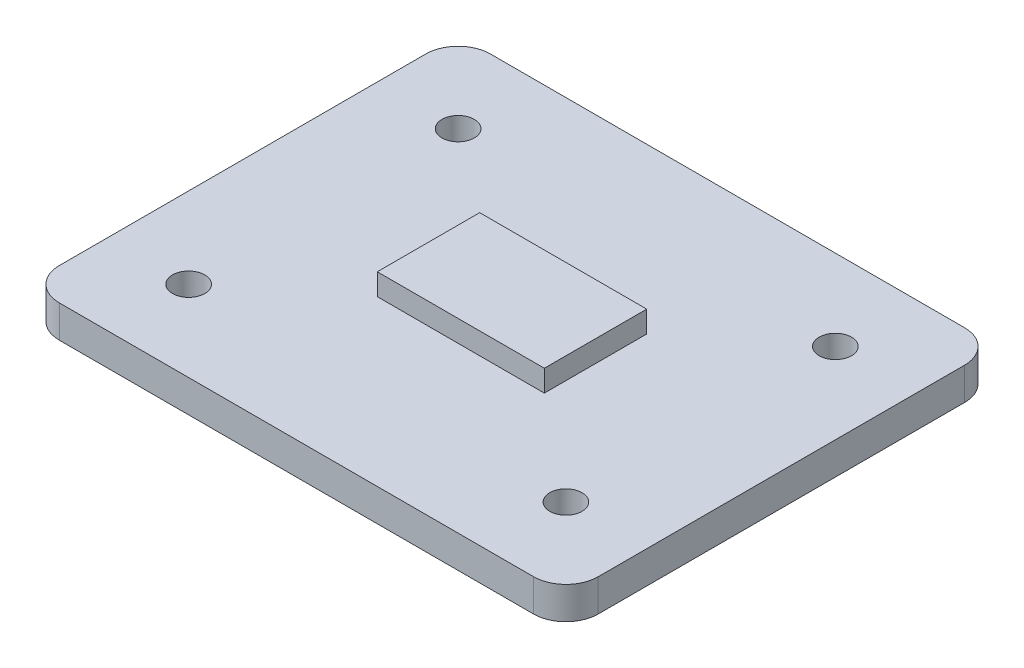
ISO-10303-21;
HEADER;
FILE_DESCRIPTION(('STEP AP214'),'2;1');
FILE_NAME('part.step','',(''),(''),'','','');
FILE_SCHEMA(('AUTOMOTIVE_DESIGN { 1 0 10303 214 1 1 1 1 }'));
ENDSEC;
DATA;
#1=APPLICATION_CONTEXT('core data for automotive mechanical design processes');
#2=APPLICATION_PROTOCOL_DEFINITION('international standard','automotive_design',2000,#1);
#3=PRODUCT_CONTEXT('',#1,'mechanical');
#4=PRODUCT('Part','Part','',(#3));
#5=PRODUCT_RELATED_PRODUCT_CATEGORY('part','',(#4));
#6=PRODUCT_DEFINITION_FORMATION('','',#4);
#7=PRODUCT_DEFINITION_CONTEXT('part definition',#1,'design');
#8=PRODUCT_DEFINITION('design','',#6,#7);
#9=PRODUCT_DEFINITION_SHAPE('','',#8);
#10=(LENGTH_UNIT() NAMED_UNIT(*) SI_UNIT(.MILLI.,.METRE.));
#11=(NAMED_UNIT(*) PLANE_ANGLE_UNIT() SI_UNIT($,.RADIAN.));
#12=(NAMED_UNIT(*) SI_UNIT($,.STERADIAN.) SOLID_ANGLE_UNIT());
#13=UNCERTAINTY_MEASURE_WITH_UNIT(LENGTH_MEASURE(1.E-05),#10,'distance_accuracy_value','');
#14=(GEOMETRIC_REPRESENTATION_CONTEXT(3) GLOBAL_UNCERTAINTY_ASSIGNED_CONTEXT((#13)) GLOBAL_UNIT_ASSIGNED_CONTEXT((#10,
#11,#12)) REPRESENTATION_CONTEXT('',''));
#15=CARTESIAN_POINT('',(0.,0.,0.));
#16=DIRECTION('',(0.,0.,1.));
#17=DIRECTION('',(1.,0.,0.));
#18=AXIS2_PLACEMENT_3D('',#15,#16,#17);
#19=CARTESIAN_POINT('',(0.,3.,0.));
#20=DIRECTION('',(0.,1.,0.));
#21=DIRECTION('',(0.,0.,1.));
#22=AXIS2_PLACEMENT_3D('',#19,#20,#21);
#23=PLANE('',#22);
#24=CARTESIAN_POINT('',(-17.5,3.,12.5));
#25=DIRECTION('',(0.,1.,0.));
#26=DIRECTION('',(0.,0.,-1.));
#27=AXIS2_PLACEMENT_3D('',#24,#25,#26);
#28=CIRCLE('',#27,1.5);
#29=CARTESIAN_POINT('',(-17.5,3.,11.));
#30=VERTEX_POINT('',#29);
#31=EDGE_CURVE('E170',#30,#30,#28,.T.);
#32=ORIENTED_EDGE('',*,*,#31,.F.);
#33=EDGE_LOOP('',(#32));
#34=FACE_BOUND('',#33,.T.);
#35=CARTESIAN_POINT('',(17.5,3.,12.5));
#36=DIRECTION('',(0.,1.,0.));
#37=DIRECTION('',(0.,0.,1.));
#38=AXIS2_PLACEMENT_3D('',#35,#36,#37);
#39=CIRCLE('',#38,1.5);
#40=CARTESIAN_POINT('',(17.5,3.,14.));
#41=VERTEX_POINT('',#40);
#42=EDGE_CURVE('E175',#41,#41,#39,.T.);
#43=ORIENTED_EDGE('',*,*,#42,.F.);
#44=EDGE_LOOP('',(#43));
#45=FACE_BOUND('',#44,.T.);
#46=CARTESIAN_POINT('',(17.5,3.,-12.5));
#47=DIRECTION('',(0.,1.,0.));
#48=DIRECTION('',(0.,0.,-1.));
#49=AXIS2_PLACEMENT_3D('',#46,#47,#48);
#50=CIRCLE('',#49,1.5);
#51=CARTESIAN_POINT('',(17.5,3.,-14.));
#52=VERTEX_POINT('',#51);
#53=EDGE_CURVE('E180',#52,#52,#50,.T.);
#54=ORIENTED_EDGE('',*,*,#53,.F.);
#55=EDGE_LOOP('',(#54));
#56=FACE_BOUND('',#55,.T.);
#57=CARTESIAN_POINT('',(-17.5,3.,-12.5));
#58=DIRECTION('',(0.,1.,0.));
#59=DIRECTION('',(0.,0.,1.));
#60=AXIS2_PLACEMENT_3D('',#57,#58,#59);
#61=CIRCLE('',#60,1.5);
#62=CARTESIAN_POINT('',(-17.5,3.,-11.));
#63=VERTEX_POINT('',#62);
#64=EDGE_CURVE('E184',#63,#63,#61,.T.);
#65=ORIENTED_EDGE('',*,*,#64,.F.);
#66=EDGE_LOOP('',(#65));
#67=FACE_BOUND('',#66,.T.);
#68=DIRECTION('',(0.,0.,1.));
#69=VECTOR('',#68,1.);
#70=CARTESIAN_POINT('',(-25.,3.,20.));
#71=LINE('',#70,#69);
#72=CARTESIAN_POINT('',(-25.,3.,-17.));
#73=VERTEX_POINT('',#72);
#74=CARTESIAN_POINT('',(-25.,3.,17.));
#75=VERTEX_POINT('',#74);
#76=EDGE_CURVE('E192',#73,#75,#71,.T.);
#77=ORIENTED_EDGE('',*,*,#76,.T.);
#78=CARTESIAN_POINT('',(-22.,3.,17.));
#79=DIRECTION('',(0.,1.,0.));
#80=DIRECTION('',(0.,0.,1.));
#81=AXIS2_PLACEMENT_3D('',#78,#79,#80);
#82=CIRCLE('',#81,3.);
#83=CARTESIAN_POINT('',(-22.,3.,20.));
#84=VERTEX_POINT('',#83);
#85=EDGE_CURVE('E257',#75,#84,#82,.T.);
#86=ORIENTED_EDGE('',*,*,#85,.T.);
#87=DIRECTION('',(1.,0.,0.));
#88=VECTOR('',#87,1.);
#89=CARTESIAN_POINT('',(25.,3.,20.));
#90=LINE('',#89,#88);
#91=CARTESIAN_POINT('',(22.,3.,20.));
#92=VERTEX_POINT('',#91);
#93=EDGE_CURVE('E196',#84,#92,#90,.T.);
#94=ORIENTED_EDGE('',*,*,#93,.T.);
#95=CARTESIAN_POINT('',(22.,3.,17.));
#96=DIRECTION('',(0.,1.,0.));
#97=DIRECTION('',(0.,0.,1.));
#98=AXIS2_PLACEMENT_3D('',#95,#96,#97);
#99=CIRCLE('',#98,3.);
#100=CARTESIAN_POINT('',(25.,3.,17.));
#101=VERTEX_POINT('',#100);
#102=EDGE_CURVE('E248',#92,#101,#99,.T.);
#103=ORIENTED_EDGE('',*,*,#102,.T.);
#104=DIRECTION('',(0.,0.,-1.));
#105=VECTOR('',#104,1.);
#106=CARTESIAN_POINT('',(25.,3.,20.));
#107=LINE('',#106,#105);
#108=CARTESIAN_POINT('',(25.,3.,-17.));
#109=VERTEX_POINT('',#108);
#110=EDGE_CURVE('E201',#101,#109,#107,.T.);
#111=ORIENTED_EDGE('',*,*,#110,.T.);
#112=CARTESIAN_POINT('',(22.,3.,-17.));
#113=DIRECTION('',(0.,1.,0.));
#114=DIRECTION('',(0.,0.,1.));
#115=AXIS2_PLACEMENT_3D('',#112,#113,#114);
#116=CIRCLE('',#115,3.);
#117=CARTESIAN_POINT('',(22.,3.,-20.));
#118=VERTEX_POINT('',#117);
#119=EDGE_CURVE('E251',#109,#118,#116,.T.);
#120=ORIENTED_EDGE('',*,*,#119,.T.);
#121=DIRECTION('',(-1.,0.,0.));
#122=VECTOR('',#121,1.);
#123=CARTESIAN_POINT('',(25.,3.,-20.));
#124=LINE('',#123,#122);
#125=CARTESIAN_POINT('',(-22.,3.,-20.));
#126=VERTEX_POINT('',#125);
#127=EDGE_CURVE('E205',#118,#126,#124,.T.);
#128=ORIENTED_EDGE('',*,*,#127,.T.);
#129=CARTESIAN_POINT('',(-22.,3.,-17.));
#130=DIRECTION('',(0.,1.,0.));
#131=DIRECTION('',(0.,0.,1.));
#132=AXIS2_PLACEMENT_3D('',#129,#130,#131);
#133=CIRCLE('',#132,3.);
#134=EDGE_CURVE('E254',#126,#73,#133,.T.);
#135=ORIENTED_EDGE('',*,*,#134,.T.);
#136=EDGE_LOOP('',(#77,#86,#94,#103,#111,#120,#128,#135));
#137=FACE_BOUND('',#136,.T.);
#138=DIRECTION('',(1.,0.,0.));
#139=VECTOR('',#138,1.);
#140=CARTESIAN_POINT('',(7.75,3.,4.75));
#141=LINE('',#140,#139);
#142=CARTESIAN_POINT('',(-7.75,3.,4.75));
#143=VERTEX_POINT('',#142);
#144=CARTESIAN_POINT('',(7.75,3.,4.75));
#145=VERTEX_POINT('',#144);
#146=EDGE_CURVE('E362',#143,#145,#141,.T.);
#147=ORIENTED_EDGE('',*,*,#146,.F.);
#148=DIRECTION('',(0.,0.,1.));
#149=VECTOR('',#148,1.);
#150=CARTESIAN_POINT('',(-7.75,3.,4.75));
#151=LINE('',#150,#149);
#152=CARTESIAN_POINT('',(-7.75,3.,-4.75));
#153=VERTEX_POINT('',#152);
#154=EDGE_CURVE('E167',#153,#143,#151,.T.);
#155=ORIENTED_EDGE('',*,*,#154,.F.);
#156=DIRECTION('',(-1.,0.,0.));
#157=VECTOR('',#156,1.);
#158=CARTESIAN_POINT('',(7.75,3.,-4.75));
#159=LINE('',#158,#157);
#160=CARTESIAN_POINT('',(7.75,3.,-4.75));
#161=VERTEX_POINT('',#160);
#162=EDGE_CURVE('E163',#161,#153,#159,.T.);
#163=ORIENTED_EDGE('',*,*,#162,.F.);
#164=DIRECTION('',(0.,0.,-1.));
#165=VECTOR('',#164,1.);
#166=CARTESIAN_POINT('',(7.75,3.,4.75));
#167=LINE('',#166,#165);
#168=EDGE_CURVE('E364',#145,#161,#167,.T.);
#169=ORIENTED_EDGE('',*,*,#168,.F.);
#170=EDGE_LOOP('',(#147,#155,#163,#169));
#171=FACE_BOUND('',#170,.T.);
#172=ADVANCED_FACE('F49',(#34,#45,#56,#67,#137,#171),#23,.T.);
#173=CARTESIAN_POINT('',(-25.,3.,20.));
#174=DIRECTION('',(1.,0.,0.));
#175=DIRECTION('',(0.,0.,-1.));
#176=AXIS2_PLACEMENT_3D('',#173,#174,#175);
#177=PLANE('',#176);
#178=DIRECTION('',(0.,0.,1.));
#179=VECTOR('',#178,1.);
#180=CARTESIAN_POINT('',(-25.,0.,20.));
#181=LINE('',#180,#179);
#182=CARTESIAN_POINT('',(-25.,0.,-17.));
#183=VERTEX_POINT('',#182);
#184=CARTESIAN_POINT('',(-25.,0.,17.));
#185=VERTEX_POINT('',#184);
#186=EDGE_CURVE('E209',#183,#185,#181,.T.);
#187=ORIENTED_EDGE('',*,*,#186,.T.);
#188=DIRECTION('',(0.,-1.,0.));
#189=VECTOR('',#188,1.);
#190=CARTESIAN_POINT('',(-25.,3.,17.));
#191=LINE('',#190,#189);
#192=EDGE_CURVE('E245',#185,#75,#191,.F.);
#193=ORIENTED_EDGE('',*,*,#192,.T.);
#194=ORIENTED_EDGE('',*,*,#76,.F.);
#195=DIRECTION('',(0.,-1.,0.));
#196=VECTOR('',#195,1.);
#197=CARTESIAN_POINT('',(-25.,3.,-17.));
#198=LINE('',#197,#196);
#199=EDGE_CURVE('E241',#73,#183,#198,.T.);
#200=ORIENTED_EDGE('',*,*,#199,.T.);
#201=EDGE_LOOP('',(#187,#193,#194,#200));
#202=FACE_BOUND('',#201,.T.);
#203=ADVANCED_FACE('F301',(#202),#177,.F.);
#204=CARTESIAN_POINT('',(25.,3.,20.));
#205=DIRECTION('',(0.,0.,-1.));
#206=DIRECTION('',(-1.,0.,0.));
#207=AXIS2_PLACEMENT_3D('',#204,#205,#206);
#208=PLANE('',#207);
#209=ORIENTED_EDGE('',*,*,#93,.F.);
#210=DIRECTION('',(0.,-1.,0.));
#211=VECTOR('',#210,1.);
#212=CARTESIAN_POINT('',(-22.,3.,20.));
#213=LINE('',#212,#211);
#214=CARTESIAN_POINT('',(-22.,0.,20.));
#215=VERTEX_POINT('',#214);
#216=EDGE_CURVE('E225',#84,#215,#213,.T.);
#217=ORIENTED_EDGE('',*,*,#216,.T.);
#218=DIRECTION('',(1.,0.,0.));
#219=VECTOR('',#218,1.);
#220=CARTESIAN_POINT('',(25.,0.,20.));
#221=LINE('',#220,#219);
#222=CARTESIAN_POINT('',(22.,0.,20.));
#223=VERTEX_POINT('',#222);
#224=EDGE_CURVE('E213',#215,#223,#221,.T.);
#225=ORIENTED_EDGE('',*,*,#224,.T.);
#226=DIRECTION('',(0.,-1.,0.));
#227=VECTOR('',#226,1.);
#228=CARTESIAN_POINT('',(22.,3.,20.));
#229=LINE('',#228,#227);
#230=EDGE_CURVE('E208',#223,#92,#229,.F.);
#231=ORIENTED_EDGE('',*,*,#230,.T.);
#232=EDGE_LOOP('',(#209,#217,#225,#231));
#233=FACE_BOUND('',#232,.T.);
#234=ADVANCED_FACE('F307',(#233),#208,.F.);
#235=CARTESIAN_POINT('',(25.,3.,20.));
#236=DIRECTION('',(-1.,0.,0.));
#237=DIRECTION('',(0.,0.,1.));
#238=AXIS2_PLACEMENT_3D('',#235,#236,#237);
#239=PLANE('',#238);
#240=DIRECTION('',(0.,0.,-1.));
#241=VECTOR('',#240,1.);
#242=CARTESIAN_POINT('',(25.,0.,20.));
#243=LINE('',#242,#241);
#244=CARTESIAN_POINT('',(25.,0.,17.));
#245=VERTEX_POINT('',#244);
#246=CARTESIAN_POINT('',(25.,0.,-17.));
#247=VERTEX_POINT('',#246);
#248=EDGE_CURVE('E217',#245,#247,#243,.T.);
#249=ORIENTED_EDGE('',*,*,#248,.T.);
#250=DIRECTION('',(0.,-1.,0.));
#251=VECTOR('',#250,1.);
#252=CARTESIAN_POINT('',(25.,3.,-17.));
#253=LINE('',#252,#251);
#254=EDGE_CURVE('E11',#247,#109,#253,.F.);
#255=ORIENTED_EDGE('',*,*,#254,.T.);
#256=ORIENTED_EDGE('',*,*,#110,.F.);
#257=DIRECTION('',(0.,-1.,0.));
#258=VECTOR('',#257,1.);
#259=CARTESIAN_POINT('',(25.,3.,17.));
#260=LINE('',#259,#258);
#261=EDGE_CURVE('E59',#101,#245,#260,.T.);
#262=ORIENTED_EDGE('',*,*,#261,.T.);
#263=EDGE_LOOP('',(#249,#255,#256,#262));
#264=FACE_BOUND('',#263,.T.);
#265=ADVANCED_FACE('F320',(#264),#239,.F.);
#266=CARTESIAN_POINT('',(25.,3.,-20.));
#267=DIRECTION('',(0.,0.,1.));
#268=DIRECTION('',(1.,0.,0.));
#269=AXIS2_PLACEMENT_3D('',#266,#267,#268);
#270=PLANE('',#269);
#271=DIRECTION('',(-1.,0.,0.));
#272=VECTOR('',#271,1.);
#273=CARTESIAN_POINT('',(25.,0.,-20.));
#274=LINE('',#273,#272);
#275=CARTESIAN_POINT('',(22.,0.,-20.));
#276=VERTEX_POINT('',#275);
#277=CARTESIAN_POINT('',(-22.,0.,-20.));
#278=VERTEX_POINT('',#277);
#279=EDGE_CURVE('E197',#276,#278,#274,.T.);
#280=ORIENTED_EDGE('',*,*,#279,.T.);
#281=DIRECTION('',(0.,-1.,0.));
#282=VECTOR('',#281,1.);
#283=CARTESIAN_POINT('',(-22.,3.,-20.));
#284=LINE('',#283,#282);
#285=EDGE_CURVE('E75',#278,#126,#284,.F.);
#286=ORIENTED_EDGE('',*,*,#285,.T.);
#287=ORIENTED_EDGE('',*,*,#127,.F.);
#288=DIRECTION('',(0.,-1.,0.));
#289=VECTOR('',#288,1.);
#290=CARTESIAN_POINT('',(22.,3.,-20.));
#291=LINE('',#290,#289);
#292=EDGE_CURVE('E260',#118,#276,#291,.T.);
#293=ORIENTED_EDGE('',*,*,#292,.T.);
#294=EDGE_LOOP('',(#280,#286,#287,#293));
#295=FACE_BOUND('',#294,.T.);
#296=ADVANCED_FACE('F317',(#295),#270,.F.);
#297=CARTESIAN_POINT('',(0.,0.,0.));
#298=DIRECTION('',(0.,1.,0.));
#299=DIRECTION('',(0.,0.,1.));
#300=AXIS2_PLACEMENT_3D('',#297,#298,#299);
#301=PLANE('',#300);
#302=CARTESIAN_POINT('',(-17.5,0.,12.5));
#303=DIRECTION('',(0.,1.,0.));
#304=DIRECTION('',(0.,0.,1.));
#305=AXIS2_PLACEMENT_3D('',#302,#303,#304);
#306=CIRCLE('',#305,1.5);
#307=CARTESIAN_POINT('',(-17.5,0.,14.));
#308=VERTEX_POINT('',#307);
#309=EDGE_CURVE('E53',#308,#308,#306,.T.);
#310=ORIENTED_EDGE('',*,*,#309,.T.);
#311=EDGE_LOOP('',(#310));
#312=FACE_BOUND('',#311,.T.);
#313=CARTESIAN_POINT('',(17.5,0.,12.5));
#314=DIRECTION('',(0.,1.,0.));
#315=DIRECTION('',(0.,0.,1.));
#316=AXIS2_PLACEMENT_3D('',#313,#314,#315);
#317=CIRCLE('',#316,1.5);
#318=CARTESIAN_POINT('',(17.5,0.,14.));
#319=VERTEX_POINT('',#318);
#320=EDGE_CURVE('E275',#319,#319,#317,.T.);
#321=ORIENTED_EDGE('',*,*,#320,.T.);
#322=EDGE_LOOP('',(#321));
#323=FACE_BOUND('',#322,.T.);
#324=CARTESIAN_POINT('',(17.5,0.,-12.5));
#325=DIRECTION('',(0.,1.,0.));
#326=DIRECTION('',(0.,0.,1.));
#327=AXIS2_PLACEMENT_3D('',#324,#325,#326);
#328=CIRCLE('',#327,1.5);
#329=CARTESIAN_POINT('',(17.5,0.,-11.));
#330=VERTEX_POINT('',#329);
#331=EDGE_CURVE('E272',#330,#330,#328,.T.);
#332=ORIENTED_EDGE('',*,*,#331,.T.);
#333=EDGE_LOOP('',(#332));
#334=FACE_BOUND('',#333,.T.);
#335=CARTESIAN_POINT('',(-17.5,0.,-12.5));
#336=DIRECTION('',(0.,1.,0.));
#337=DIRECTION('',(0.,0.,1.));
#338=AXIS2_PLACEMENT_3D('',#335,#336,#337);
#339=CIRCLE('',#338,1.5);
#340=CARTESIAN_POINT('',(-17.5,0.,-11.));
#341=VERTEX_POINT('',#340);
#342=EDGE_CURVE('E191',#341,#341,#339,.T.);
#343=ORIENTED_EDGE('',*,*,#342,.T.);
#344=EDGE_LOOP('',(#343));
#345=FACE_BOUND('',#344,.T.);
#346=ORIENTED_EDGE('',*,*,#224,.F.);
#347=CARTESIAN_POINT('',(-22.,0.,17.));
#348=DIRECTION('',(0.,1.,0.));
#349=DIRECTION('',(0.,0.,1.));
#350=AXIS2_PLACEMENT_3D('',#347,#348,#349);
#351=CIRCLE('',#350,3.);
#352=EDGE_CURVE('E238',#215,#185,#351,.F.);
#353=ORIENTED_EDGE('',*,*,#352,.T.);
#354=ORIENTED_EDGE('',*,*,#186,.F.);
#355=CARTESIAN_POINT('',(-22.,0.,-17.));
#356=DIRECTION('',(0.,1.,0.));
#357=DIRECTION('',(0.,0.,1.));
#358=AXIS2_PLACEMENT_3D('',#355,#356,#357);
#359=CIRCLE('',#358,3.);
#360=EDGE_CURVE('E235',#183,#278,#359,.F.);
#361=ORIENTED_EDGE('',*,*,#360,.T.);
#362=ORIENTED_EDGE('',*,*,#279,.F.);
#363=CARTESIAN_POINT('',(22.,0.,-17.));
#364=DIRECTION('',(0.,1.,0.));
#365=DIRECTION('',(0.,0.,1.));
#366=AXIS2_PLACEMENT_3D('',#363,#364,#365);
#367=CIRCLE('',#366,3.);
#368=EDGE_CURVE('E232',#276,#247,#367,.F.);
#369=ORIENTED_EDGE('',*,*,#368,.T.);
#370=ORIENTED_EDGE('',*,*,#248,.F.);
#371=CARTESIAN_POINT('',(22.,0.,17.));
#372=DIRECTION('',(0.,1.,0.));
#373=DIRECTION('',(0.,0.,1.));
#374=AXIS2_PLACEMENT_3D('',#371,#372,#373);
#375=CIRCLE('',#374,3.);
#376=EDGE_CURVE('E229',#245,#223,#375,.F.);
#377=ORIENTED_EDGE('',*,*,#376,.T.);
#378=EDGE_LOOP('',(#346,#353,#354,#361,#362,#369,#370,#377));
#379=FACE_BOUND('',#378,.T.);
#380=ADVANCED_FACE('F284',(#312,#323,#334,#345,#379),#301,.F.);
#381=CARTESIAN_POINT('',(-22.,3.,17.));
#382=DIRECTION('',(0.,-1.,0.));
#383=DIRECTION('',(0.,0.,-1.));
#384=AXIS2_PLACEMENT_3D('',#381,#382,#383);
#385=CYLINDRICAL_SURFACE('',#384,3.);
#386=ORIENTED_EDGE('',*,*,#85,.F.);
#387=ORIENTED_EDGE('',*,*,#192,.F.);
#388=ORIENTED_EDGE('',*,*,#352,.F.);
#389=ORIENTED_EDGE('',*,*,#216,.F.);
#390=EDGE_LOOP('',(#386,#387,#388,#389));
#391=FACE_BOUND('',#390,.T.);
#392=ADVANCED_FACE('F316',(#391),#385,.T.);
#393=CARTESIAN_POINT('',(-22.,3.,-17.));
#394=DIRECTION('',(0.,-1.,0.));
#395=DIRECTION('',(0.,0.,-1.));
#396=AXIS2_PLACEMENT_3D('',#393,#394,#395);
#397=CYLINDRICAL_SURFACE('',#396,3.);
#398=ORIENTED_EDGE('',*,*,#134,.F.);
#399=ORIENTED_EDGE('',*,*,#285,.F.);
#400=ORIENTED_EDGE('',*,*,#360,.F.);
#401=ORIENTED_EDGE('',*,*,#199,.F.);
#402=EDGE_LOOP('',(#398,#399,#400,#401));
#403=FACE_BOUND('',#402,.T.);
#404=ADVANCED_FACE('F329',(#403),#397,.T.);
#405=CARTESIAN_POINT('',(22.,3.,-17.));
#406=DIRECTION('',(0.,-1.,0.));
#407=DIRECTION('',(0.,0.,-1.));
#408=AXIS2_PLACEMENT_3D('',#405,#406,#407);
#409=CYLINDRICAL_SURFACE('',#408,3.);
#410=ORIENTED_EDGE('',*,*,#119,.F.);
#411=ORIENTED_EDGE('',*,*,#254,.F.);
#412=ORIENTED_EDGE('',*,*,#368,.F.);
#413=ORIENTED_EDGE('',*,*,#292,.F.);
#414=EDGE_LOOP('',(#410,#411,#412,#413));
#415=FACE_BOUND('',#414,.T.);
#416=ADVANCED_FACE('F332',(#415),#409,.T.);
#417=CARTESIAN_POINT('',(22.,3.,17.));
#418=DIRECTION('',(0.,-1.,0.));
#419=DIRECTION('',(0.,0.,-1.));
#420=AXIS2_PLACEMENT_3D('',#417,#418,#419);
#421=CYLINDRICAL_SURFACE('',#420,3.);
#422=ORIENTED_EDGE('',*,*,#102,.F.);
#423=ORIENTED_EDGE('',*,*,#230,.F.);
#424=ORIENTED_EDGE('',*,*,#376,.F.);
#425=ORIENTED_EDGE('',*,*,#261,.F.);
#426=EDGE_LOOP('',(#422,#423,#424,#425));
#427=FACE_BOUND('',#426,.T.);
#428=ADVANCED_FACE('F51',(#427),#421,.T.);
#429=CARTESIAN_POINT('',(-17.5,-6.,-12.5));
#430=DIRECTION('',(0.,1.,0.));
#431=DIRECTION('',(0.,0.,1.));
#432=AXIS2_PLACEMENT_3D('',#429,#430,#431);
#433=CYLINDRICAL_SURFACE('',#432,1.5);
#434=ORIENTED_EDGE('',*,*,#64,.T.);
#435=EDGE_LOOP('',(#434));
#436=FACE_BOUND('',#435,.T.);
#437=ORIENTED_EDGE('',*,*,#342,.F.);
#438=EDGE_LOOP('',(#437));
#439=FACE_BOUND('',#438,.T.);
#440=ADVANCED_FACE('F313',(#436,#439),#433,.F.);
#441=CARTESIAN_POINT('',(17.5,-6.,-12.5));
#442=DIRECTION('',(0.,1.,0.));
#443=DIRECTION('',(0.,0.,1.));
#444=AXIS2_PLACEMENT_3D('',#441,#442,#443);
#445=CYLINDRICAL_SURFACE('',#444,1.5);
#446=ORIENTED_EDGE('',*,*,#53,.T.);
#447=EDGE_LOOP('',(#446));
#448=FACE_BOUND('',#447,.T.);
#449=ORIENTED_EDGE('',*,*,#331,.F.);
#450=EDGE_LOOP('',(#449));
#451=FACE_BOUND('',#450,.T.);
#452=ADVANCED_FACE('F296',(#448,#451),#445,.F.);
#453=CARTESIAN_POINT('',(17.5,-6.,12.5));
#454=DIRECTION('',(0.,1.,0.));
#455=DIRECTION('',(0.,0.,1.));
#456=AXIS2_PLACEMENT_3D('',#453,#454,#455);
#457=CYLINDRICAL_SURFACE('',#456,1.5);
#458=ORIENTED_EDGE('',*,*,#42,.T.);
#459=EDGE_LOOP('',(#458));
#460=FACE_BOUND('',#459,.T.);
#461=ORIENTED_EDGE('',*,*,#320,.F.);
#462=EDGE_LOOP('',(#461));
#463=FACE_BOUND('',#462,.T.);
#464=ADVANCED_FACE('F288',(#460,#463),#457,.F.);
#465=CARTESIAN_POINT('',(-17.5,-6.,12.5));
#466=DIRECTION('',(0.,1.,0.));
#467=DIRECTION('',(0.,0.,1.));
#468=AXIS2_PLACEMENT_3D('',#465,#466,#467);
#469=CYLINDRICAL_SURFACE('',#468,1.5);
#470=ORIENTED_EDGE('',*,*,#31,.T.);
#471=EDGE_LOOP('',(#470));
#472=FACE_BOUND('',#471,.T.);
#473=ORIENTED_EDGE('',*,*,#309,.F.);
#474=EDGE_LOOP('',(#473));
#475=FACE_BOUND('',#474,.T.);
#476=ADVANCED_FACE('F286',(#472,#475),#469,.F.);
#477=CARTESIAN_POINT('',(-7.75,5.,4.75));
#478=DIRECTION('',(1.,0.,0.));
#479=DIRECTION('',(0.,0.,-1.));
#480=AXIS2_PLACEMENT_3D('',#477,#478,#479);
#481=PLANE('',#480);
#482=ORIENTED_EDGE('',*,*,#154,.T.);
#483=DIRECTION('',(0.,-1.,0.));
#484=VECTOR('',#483,1.);
#485=CARTESIAN_POINT('',(-7.75,5.,4.75));
#486=LINE('',#485,#484);
#487=CARTESIAN_POINT('',(-7.75,5.,4.75));
#488=VERTEX_POINT('',#487);
#489=EDGE_CURVE('E146',#488,#143,#486,.T.);
#490=ORIENTED_EDGE('',*,*,#489,.F.);
#491=DIRECTION('',(0.,0.,1.));
#492=VECTOR('',#491,1.);
#493=CARTESIAN_POINT('',(-7.75,5.,4.75));
#494=LINE('',#493,#492);
#495=CARTESIAN_POINT('',(-7.75,5.,-4.75));
#496=VERTEX_POINT('',#495);
#497=EDGE_CURVE('E154',#496,#488,#494,.T.);
#498=ORIENTED_EDGE('',*,*,#497,.F.);
#499=DIRECTION('',(0.,-1.,0.));
#500=VECTOR('',#499,1.);
#501=CARTESIAN_POINT('',(-7.75,5.,-4.75));
#502=LINE('',#501,#500);
#503=EDGE_CURVE('E375',#496,#153,#502,.T.);
#504=ORIENTED_EDGE('',*,*,#503,.T.);
#505=EDGE_LOOP('',(#482,#490,#498,#504));
#506=FACE_BOUND('',#505,.T.);
#507=ADVANCED_FACE('F165',(#506),#481,.F.);
#508=CARTESIAN_POINT('',(7.75,5.,4.75));
#509=DIRECTION('',(0.,0.,-1.));
#510=DIRECTION('',(-1.,0.,0.));
#511=AXIS2_PLACEMENT_3D('',#508,#509,#510);
#512=PLANE('',#511);
#513=ORIENTED_EDGE('',*,*,#146,.T.);
#514=DIRECTION('',(0.,-1.,0.));
#515=VECTOR('',#514,1.);
#516=CARTESIAN_POINT('',(7.75,5.,4.75));
#517=LINE('',#516,#515);
#518=CARTESIAN_POINT('',(7.75,5.,4.75));
#519=VERTEX_POINT('',#518);
#520=EDGE_CURVE('E149',#519,#145,#517,.T.);
#521=ORIENTED_EDGE('',*,*,#520,.F.);
#522=DIRECTION('',(1.,0.,0.));
#523=VECTOR('',#522,1.);
#524=CARTESIAN_POINT('',(7.75,5.,4.75));
#525=LINE('',#524,#523);
#526=EDGE_CURVE('E142',#488,#519,#525,.T.);
#527=ORIENTED_EDGE('',*,*,#526,.F.);
#528=ORIENTED_EDGE('',*,*,#489,.T.);
#529=EDGE_LOOP('',(#513,#521,#527,#528));
#530=FACE_BOUND('',#529,.T.);
#531=ADVANCED_FACE('F144',(#530),#512,.F.);
#532=CARTESIAN_POINT('',(7.75,5.,4.75));
#533=DIRECTION('',(-1.,0.,0.));
#534=DIRECTION('',(0.,0.,1.));
#535=AXIS2_PLACEMENT_3D('',#532,#533,#534);
#536=PLANE('',#535);
#537=ORIENTED_EDGE('',*,*,#168,.T.);
#538=DIRECTION('',(0.,-1.,0.));
#539=VECTOR('',#538,1.);
#540=CARTESIAN_POINT('',(7.75,5.,-4.75));
#541=LINE('',#540,#539);
#542=CARTESIAN_POINT('',(7.75,5.,-4.75));
#543=VERTEX_POINT('',#542);
#544=EDGE_CURVE('E67',#543,#161,#541,.T.);
#545=ORIENTED_EDGE('',*,*,#544,.F.);
#546=DIRECTION('',(0.,0.,-1.));
#547=VECTOR('',#546,1.);
#548=CARTESIAN_POINT('',(7.75,5.,4.75));
#549=LINE('',#548,#547);
#550=EDGE_CURVE('E153',#519,#543,#549,.T.);
#551=ORIENTED_EDGE('',*,*,#550,.F.);
#552=ORIENTED_EDGE('',*,*,#520,.T.);
#553=EDGE_LOOP('',(#537,#545,#551,#552));
#554=FACE_BOUND('',#553,.T.);
#555=ADVANCED_FACE('F382',(#554),#536,.F.);
#556=CARTESIAN_POINT('',(7.75,5.,-4.75));
#557=DIRECTION('',(0.,0.,1.));
#558=DIRECTION('',(1.,0.,0.));
#559=AXIS2_PLACEMENT_3D('',#556,#557,#558);
#560=PLANE('',#559);
#561=ORIENTED_EDGE('',*,*,#162,.T.);
#562=ORIENTED_EDGE('',*,*,#503,.F.);
#563=DIRECTION('',(-1.,0.,0.));
#564=VECTOR('',#563,1.);
#565=CARTESIAN_POINT('',(7.75,5.,-4.75));
#566=LINE('',#565,#564);
#567=EDGE_CURVE('E158',#543,#496,#566,.T.);
#568=ORIENTED_EDGE('',*,*,#567,.F.);
#569=ORIENTED_EDGE('',*,*,#544,.T.);
#570=EDGE_LOOP('',(#561,#562,#568,#569));
#571=FACE_BOUND('',#570,.T.);
#572=ADVANCED_FACE('F383',(#571),#560,.F.);
#573=CARTESIAN_POINT('',(0.,5.,0.));
#574=DIRECTION('',(0.,1.,0.));
#575=DIRECTION('',(0.,0.,1.));
#576=AXIS2_PLACEMENT_3D('',#573,#574,#575);
#577=PLANE('',#576);
#578=ORIENTED_EDGE('',*,*,#497,.T.);
#579=ORIENTED_EDGE('',*,*,#526,.T.);
#580=ORIENTED_EDGE('',*,*,#550,.T.);
#581=ORIENTED_EDGE('',*,*,#567,.T.);
#582=EDGE_LOOP('',(#578,#579,#580,#581));
#583=FACE_BOUND('',#582,.T.);
#584=ADVANCED_FACE('F157',(#583),#577,.T.);
#585=CLOSED_SHELL('',(#172,#203,#234,#265,#296,#380,#392,#404,#416,#428,#440,#452,#464,#476,
#507,#531,#555,#572,#584));
#586=MANIFOLD_SOLID_BREP('B2',#585);
#587=ADVANCED_BREP_SHAPE_REPRESENTATION('',(#18,#586),#14);
#588=SHAPE_DEFINITION_REPRESENTATION(#9,#587);
ENDSEC;
END-ISO-10303-21;
